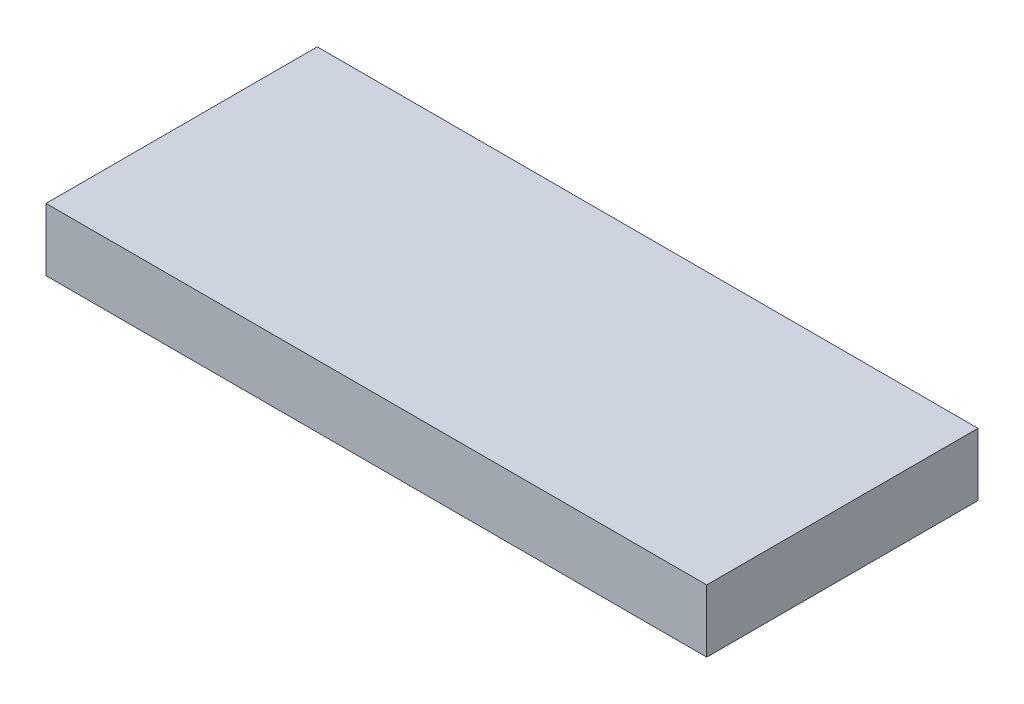
ISO-10303-21;
HEADER;
FILE_DESCRIPTION(('STEP AP214'),'2;1');
FILE_NAME('part.step','',(''),(''),'','','');
FILE_SCHEMA(('AUTOMOTIVE_DESIGN { 1 0 10303 214 1 1 1 1 }'));
ENDSEC;
DATA;
#1=APPLICATION_CONTEXT('core data for automotive mechanical design processes');
#2=APPLICATION_PROTOCOL_DEFINITION('international standard','automotive_design',2000,#1);
#3=PRODUCT_CONTEXT('',#1,'mechanical');
#4=PRODUCT('Part','Part','',(#3));
#5=PRODUCT_RELATED_PRODUCT_CATEGORY('part','',(#4));
#6=PRODUCT_DEFINITION_FORMATION('','',#4);
#7=PRODUCT_DEFINITION_CONTEXT('part definition',#1,'design');
#8=PRODUCT_DEFINITION('design','',#6,#7);
#9=PRODUCT_DEFINITION_SHAPE('','',#8);
#10=(LENGTH_UNIT() NAMED_UNIT(*) SI_UNIT(.MILLI.,.METRE.));
#11=(NAMED_UNIT(*) PLANE_ANGLE_UNIT() SI_UNIT($,.RADIAN.));
#12=(NAMED_UNIT(*) SI_UNIT($,.STERADIAN.) SOLID_ANGLE_UNIT());
#13=UNCERTAINTY_MEASURE_WITH_UNIT(LENGTH_MEASURE(1.E-05),#10,'distance_accuracy_value','');
#14=(GEOMETRIC_REPRESENTATION_CONTEXT(3) GLOBAL_UNCERTAINTY_ASSIGNED_CONTEXT((#13)) GLOBAL_UNIT_ASSIGNED_CONTEXT((#10,
#11,#12)) REPRESENTATION_CONTEXT('',''));
#15=CARTESIAN_POINT('',(0.,0.,0.));
#16=DIRECTION('',(0.,0.,1.));
#17=DIRECTION('',(1.,0.,0.));
#18=AXIS2_PLACEMENT_3D('',#15,#16,#17);
#19=CARTESIAN_POINT('',(23.75,4.5,-9.75000000000001));
#20=DIRECTION('',(-1.,0.,0.));
#21=DIRECTION('',(0.,0.,1.));
#22=AXIS2_PLACEMENT_3D('',#19,#20,#21);
#23=PLANE('',#22);
#24=DIRECTION('',(0.,0.,-1.));
#25=VECTOR('',#24,1.);
#26=CARTESIAN_POINT('',(23.75,0.,-9.75000000000001));
#27=LINE('',#26,#25);
#28=CARTESIAN_POINT('',(23.75,0.,9.74999999999999));
#29=VERTEX_POINT('',#28);
#30=CARTESIAN_POINT('',(23.75,0.,-9.75000000000001));
#31=VERTEX_POINT('',#30);
#32=EDGE_CURVE('E111',#29,#31,#27,.T.);
#33=ORIENTED_EDGE('',*,*,#32,.T.);
#34=DIRECTION('',(0.,-1.,0.));
#35=VECTOR('',#34,1.);
#36=CARTESIAN_POINT('',(23.75,4.5,-9.75000000000001));
#37=LINE('',#36,#35);
#38=CARTESIAN_POINT('',(23.75,4.5,-9.75000000000001));
#39=VERTEX_POINT('',#38);
#40=EDGE_CURVE('E12',#39,#31,#37,.T.);
#41=ORIENTED_EDGE('',*,*,#40,.F.);
#42=DIRECTION('',(0.,0.,-1.));
#43=VECTOR('',#42,1.);
#44=CARTESIAN_POINT('',(23.75,4.5,-9.75000000000001));
#45=LINE('',#44,#43);
#46=CARTESIAN_POINT('',(23.75,4.5,9.74999999999999));
#47=VERTEX_POINT('',#46);
#48=EDGE_CURVE('E84',#47,#39,#45,.T.);
#49=ORIENTED_EDGE('',*,*,#48,.F.);
#50=DIRECTION('',(0.,-1.,0.));
#51=VECTOR('',#50,1.);
#52=CARTESIAN_POINT('',(23.75,4.5,9.74999999999999));
#53=LINE('',#52,#51);
#54=EDGE_CURVE('E92',#47,#29,#53,.T.);
#55=ORIENTED_EDGE('',*,*,#54,.T.);
#56=EDGE_LOOP('',(#33,#41,#49,#55));
#57=FACE_BOUND('',#56,.T.);
#58=ADVANCED_FACE('F33',(#57),#23,.F.);
#59=CARTESIAN_POINT('',(-23.75,4.5,-9.75000000000001));
#60=DIRECTION('',(0.,0.,1.));
#61=DIRECTION('',(1.,0.,0.));
#62=AXIS2_PLACEMENT_3D('',#59,#60,#61);
#63=PLANE('',#62);
#64=DIRECTION('',(-1.,0.,0.));
#65=VECTOR('',#64,1.);
#66=CARTESIAN_POINT('',(-23.75,0.,-9.75000000000001));
#67=LINE('',#66,#65);
#68=CARTESIAN_POINT('',(-23.75,0.,-9.75000000000001));
#69=VERTEX_POINT('',#68);
#70=EDGE_CURVE('E88',#31,#69,#67,.T.);
#71=ORIENTED_EDGE('',*,*,#70,.T.);
#72=DIRECTION('',(0.,-1.,0.));
#73=VECTOR('',#72,1.);
#74=CARTESIAN_POINT('',(-23.75,4.5,-9.75000000000001));
#75=LINE('',#74,#73);
#76=CARTESIAN_POINT('',(-23.75,4.5,-9.75000000000001));
#77=VERTEX_POINT('',#76);
#78=EDGE_CURVE('E41',#77,#69,#75,.T.);
#79=ORIENTED_EDGE('',*,*,#78,.F.);
#80=DIRECTION('',(-1.,0.,0.));
#81=VECTOR('',#80,1.);
#82=CARTESIAN_POINT('',(-23.75,4.5,-9.75000000000001));
#83=LINE('',#82,#81);
#84=EDGE_CURVE('E79',#39,#77,#83,.T.);
#85=ORIENTED_EDGE('',*,*,#84,.F.);
#86=ORIENTED_EDGE('',*,*,#40,.T.);
#87=EDGE_LOOP('',(#71,#79,#85,#86));
#88=FACE_BOUND('',#87,.T.);
#89=ADVANCED_FACE('F87',(#88),#63,.F.);
#90=CARTESIAN_POINT('',(-23.75,4.5,-9.75000000000001));
#91=DIRECTION('',(1.,0.,0.));
#92=DIRECTION('',(0.,0.,-1.));
#93=AXIS2_PLACEMENT_3D('',#90,#91,#92);
#94=PLANE('',#93);
#95=DIRECTION('',(0.,0.,1.));
#96=VECTOR('',#95,1.);
#97=CARTESIAN_POINT('',(-23.75,0.,-9.75000000000001));
#98=LINE('',#97,#96);
#99=CARTESIAN_POINT('',(-23.75,0.,9.74999999999999));
#100=VERTEX_POINT('',#99);
#101=EDGE_CURVE('E66',#69,#100,#98,.T.);
#102=ORIENTED_EDGE('',*,*,#101,.T.);
#103=DIRECTION('',(0.,-1.,0.));
#104=VECTOR('',#103,1.);
#105=CARTESIAN_POINT('',(-23.75,4.5,9.74999999999999));
#106=LINE('',#105,#104);
#107=CARTESIAN_POINT('',(-23.75,4.5,9.74999999999999));
#108=VERTEX_POINT('',#107);
#109=EDGE_CURVE('E89',#108,#100,#106,.T.);
#110=ORIENTED_EDGE('',*,*,#109,.F.);
#111=DIRECTION('',(0.,0.,1.));
#112=VECTOR('',#111,1.);
#113=CARTESIAN_POINT('',(-23.75,4.5,-9.75000000000001));
#114=LINE('',#113,#112);
#115=EDGE_CURVE('E82',#77,#108,#114,.T.);
#116=ORIENTED_EDGE('',*,*,#115,.F.);
#117=ORIENTED_EDGE('',*,*,#78,.T.);
#118=EDGE_LOOP('',(#102,#110,#116,#117));
#119=FACE_BOUND('',#118,.T.);
#120=ADVANCED_FACE('F90',(#119),#94,.F.);
#121=CARTESIAN_POINT('',(-23.75,4.5,9.74999999999999));
#122=DIRECTION('',(0.,0.,-1.));
#123=DIRECTION('',(-1.,0.,0.));
#124=AXIS2_PLACEMENT_3D('',#121,#122,#123);
#125=PLANE('',#124);
#126=DIRECTION('',(1.,0.,0.));
#127=VECTOR('',#126,1.);
#128=CARTESIAN_POINT('',(-23.75,0.,9.74999999999999));
#129=LINE('',#128,#127);
#130=EDGE_CURVE('E72',#100,#29,#129,.T.);
#131=ORIENTED_EDGE('',*,*,#130,.T.);
#132=ORIENTED_EDGE('',*,*,#54,.F.);
#133=DIRECTION('',(1.,0.,0.));
#134=VECTOR('',#133,1.);
#135=CARTESIAN_POINT('',(-23.75,4.5,9.74999999999999));
#136=LINE('',#135,#134);
#137=EDGE_CURVE('E49',#108,#47,#136,.T.);
#138=ORIENTED_EDGE('',*,*,#137,.F.);
#139=ORIENTED_EDGE('',*,*,#109,.T.);
#140=EDGE_LOOP('',(#131,#132,#138,#139));
#141=FACE_BOUND('',#140,.T.);
#142=ADVANCED_FACE('F106',(#141),#125,.F.);
#143=CARTESIAN_POINT('',(0.,4.5,0.));
#144=DIRECTION('',(0.,1.,0.));
#145=DIRECTION('',(0.,0.,1.));
#146=AXIS2_PLACEMENT_3D('',#143,#144,#145);
#147=PLANE('',#146);
#148=ORIENTED_EDGE('',*,*,#48,.T.);
#149=ORIENTED_EDGE('',*,*,#84,.T.);
#150=ORIENTED_EDGE('',*,*,#115,.T.);
#151=ORIENTED_EDGE('',*,*,#137,.T.);
#152=EDGE_LOOP('',(#148,#149,#150,#151));
#153=FACE_BOUND('',#152,.T.);
#154=ADVANCED_FACE('F80',(#153),#147,.T.);
#155=CARTESIAN_POINT('',(0.,0.,0.));
#156=DIRECTION('',(0.,1.,0.));
#157=DIRECTION('',(0.,0.,1.));
#158=AXIS2_PLACEMENT_3D('',#155,#156,#157);
#159=PLANE('',#158);
#160=ORIENTED_EDGE('',*,*,#32,.F.);
#161=ORIENTED_EDGE('',*,*,#130,.F.);
#162=ORIENTED_EDGE('',*,*,#101,.F.);
#163=ORIENTED_EDGE('',*,*,#70,.F.);
#164=EDGE_LOOP('',(#160,#161,#162,#163));
#165=FACE_BOUND('',#164,.T.);
#166=ADVANCED_FACE('F109',(#165),#159,.F.);
#167=CLOSED_SHELL('',(#58,#89,#120,#142,#154,#166));
#168=MANIFOLD_SOLID_BREP('B2',#167);
#169=ADVANCED_BREP_SHAPE_REPRESENTATION('',(#18,#168),#14);
#170=SHAPE_DEFINITION_REPRESENTATION(#9,#169);
ENDSEC;
END-ISO-10303-21;
